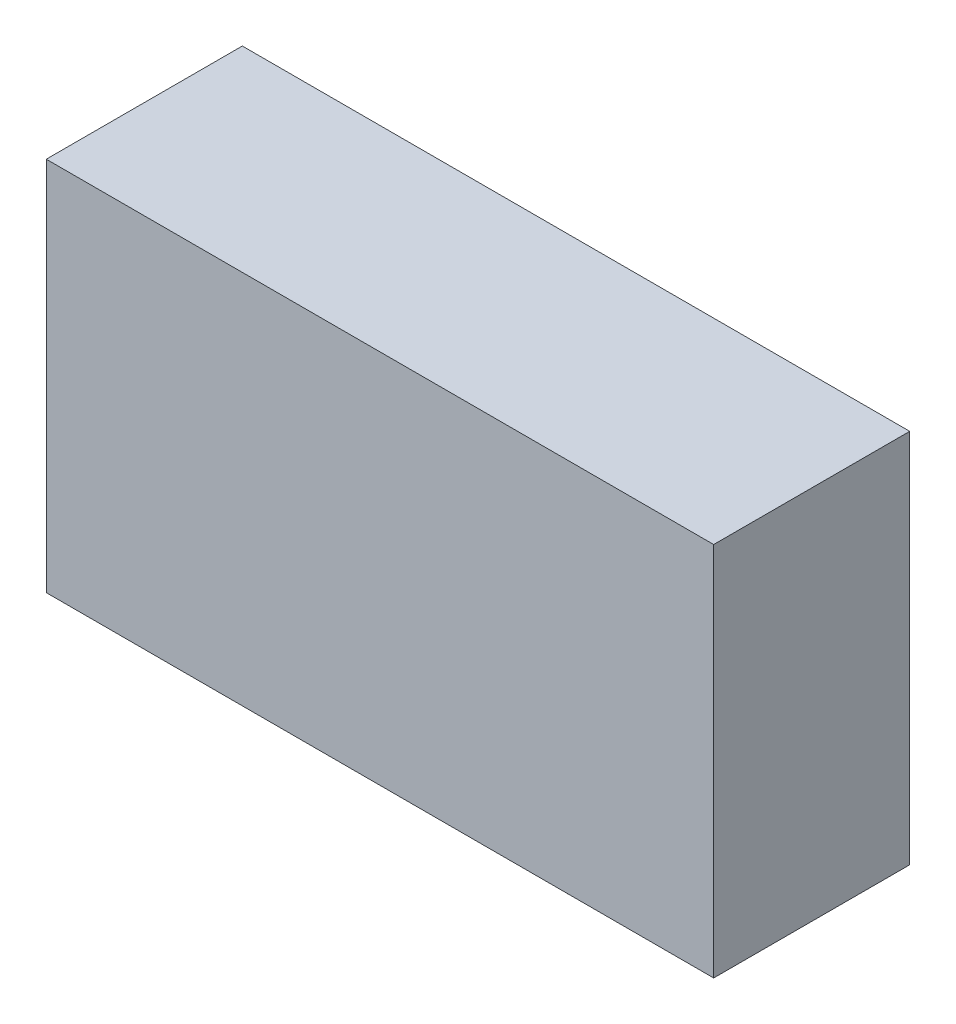
ISO-10303-21;
HEADER;
FILE_DESCRIPTION(('STEP AP214'),'2;1');
FILE_NAME('part.step','',(''),(''),'','','');
FILE_SCHEMA(('AUTOMOTIVE_DESIGN { 1 0 10303 214 1 1 1 1 }'));
ENDSEC;
DATA;
#1=APPLICATION_CONTEXT('core data for automotive mechanical design processes');
#2=APPLICATION_PROTOCOL_DEFINITION('international standard','automotive_design',2000,#1);
#3=PRODUCT_CONTEXT('',#1,'mechanical');
#4=PRODUCT('Part','Part','',(#3));
#5=PRODUCT_RELATED_PRODUCT_CATEGORY('part','',(#4));
#6=PRODUCT_DEFINITION_FORMATION('','',#4);
#7=PRODUCT_DEFINITION_CONTEXT('part definition',#1,'design');
#8=PRODUCT_DEFINITION('design','',#6,#7);
#9=PRODUCT_DEFINITION_SHAPE('','',#8);
#10=(LENGTH_UNIT() NAMED_UNIT(*) SI_UNIT(.MILLI.,.METRE.));
#11=(NAMED_UNIT(*) PLANE_ANGLE_UNIT() SI_UNIT($,.RADIAN.));
#12=(NAMED_UNIT(*) SI_UNIT($,.STERADIAN.) SOLID_ANGLE_UNIT());
#13=UNCERTAINTY_MEASURE_WITH_UNIT(LENGTH_MEASURE(1.E-05),#10,'distance_accuracy_value','');
#14=(GEOMETRIC_REPRESENTATION_CONTEXT(3) GLOBAL_UNCERTAINTY_ASSIGNED_CONTEXT((#13)) GLOBAL_UNIT_ASSIGNED_CONTEXT((#10,
#11,#12)) REPRESENTATION_CONTEXT('',''));
#15=CARTESIAN_POINT('',(0.,0.,0.));
#16=DIRECTION('',(0.,0.,1.));
#17=DIRECTION('',(1.,0.,0.));
#18=AXIS2_PLACEMENT_3D('',#15,#16,#17);
#19=CARTESIAN_POINT('',(0.,0.,2.35));
#20=DIRECTION('',(1.,0.,0.));
#21=DIRECTION('',(0.,0.,-1.));
#22=AXIS2_PLACEMENT_3D('',#19,#20,#21);
#23=PLANE('',#22);
#24=DIRECTION('',(0.,-1.,0.));
#25=VECTOR('',#24,1.);
#26=CARTESIAN_POINT('',(0.,0.,0.));
#27=LINE('',#26,#25);
#28=CARTESIAN_POINT('',(0.,4.5,0.));
#29=VERTEX_POINT('',#28);
#30=CARTESIAN_POINT('',(0.,0.,0.));
#31=VERTEX_POINT('',#30);
#32=EDGE_CURVE('E111',#29,#31,#27,.T.);
#33=ORIENTED_EDGE('',*,*,#32,.T.);
#34=DIRECTION('',(0.,0.,-1.));
#35=VECTOR('',#34,1.);
#36=CARTESIAN_POINT('',(0.,0.,2.35));
#37=LINE('',#36,#35);
#38=CARTESIAN_POINT('',(0.,0.,2.35));
#39=VERTEX_POINT('',#38);
#40=EDGE_CURVE('E11',#39,#31,#37,.T.);
#41=ORIENTED_EDGE('',*,*,#40,.F.);
#42=DIRECTION('',(0.,-1.,0.));
#43=VECTOR('',#42,1.);
#44=CARTESIAN_POINT('',(0.,0.,2.35));
#45=LINE('',#44,#43);
#46=CARTESIAN_POINT('',(0.,4.5,2.35));
#47=VERTEX_POINT('',#46);
#48=EDGE_CURVE('E95',#47,#39,#45,.T.);
#49=ORIENTED_EDGE('',*,*,#48,.F.);
#50=DIRECTION('',(0.,0.,-1.));
#51=VECTOR('',#50,1.);
#52=CARTESIAN_POINT('',(0.,4.5,2.35));
#53=LINE('',#52,#51);
#54=EDGE_CURVE('E107',#47,#29,#53,.T.);
#55=ORIENTED_EDGE('',*,*,#54,.T.);
#56=EDGE_LOOP('',(#33,#41,#49,#55));
#57=FACE_BOUND('',#56,.T.);
#58=ADVANCED_FACE('F43',(#57),#23,.F.);
#59=CARTESIAN_POINT('',(0.,0.,2.35));
#60=DIRECTION('',(0.,1.,0.));
#61=DIRECTION('',(0.,0.,1.));
#62=AXIS2_PLACEMENT_3D('',#59,#60,#61);
#63=PLANE('',#62);
#64=DIRECTION('',(1.,0.,0.));
#65=VECTOR('',#64,1.);
#66=CARTESIAN_POINT('',(0.,0.,0.));
#67=LINE('',#66,#65);
#68=CARTESIAN_POINT('',(8.,0.,0.));
#69=VERTEX_POINT('',#68);
#70=EDGE_CURVE('E100',#31,#69,#67,.T.);
#71=ORIENTED_EDGE('',*,*,#70,.T.);
#72=DIRECTION('',(0.,0.,-1.));
#73=VECTOR('',#72,1.);
#74=CARTESIAN_POINT('',(8.,0.,2.35));
#75=LINE('',#74,#73);
#76=CARTESIAN_POINT('',(8.,0.,2.35));
#77=VERTEX_POINT('',#76);
#78=EDGE_CURVE('E52',#77,#69,#75,.T.);
#79=ORIENTED_EDGE('',*,*,#78,.F.);
#80=DIRECTION('',(1.,0.,0.));
#81=VECTOR('',#80,1.);
#82=CARTESIAN_POINT('',(0.,0.,2.35));
#83=LINE('',#82,#81);
#84=EDGE_CURVE('E90',#39,#77,#83,.T.);
#85=ORIENTED_EDGE('',*,*,#84,.F.);
#86=ORIENTED_EDGE('',*,*,#40,.T.);
#87=EDGE_LOOP('',(#71,#79,#85,#86));
#88=FACE_BOUND('',#87,.T.);
#89=ADVANCED_FACE('F99',(#88),#63,.F.);
#90=CARTESIAN_POINT('',(8.,0.,2.35));
#91=DIRECTION('',(-1.,0.,0.));
#92=DIRECTION('',(0.,0.,1.));
#93=AXIS2_PLACEMENT_3D('',#90,#91,#92);
#94=PLANE('',#93);
#95=DIRECTION('',(0.,1.,0.));
#96=VECTOR('',#95,1.);
#97=CARTESIAN_POINT('',(8.,0.,0.));
#98=LINE('',#97,#96);
#99=CARTESIAN_POINT('',(8.,4.5,0.));
#100=VERTEX_POINT('',#99);
#101=EDGE_CURVE('E77',#69,#100,#98,.T.);
#102=ORIENTED_EDGE('',*,*,#101,.T.);
#103=DIRECTION('',(0.,0.,-1.));
#104=VECTOR('',#103,1.);
#105=CARTESIAN_POINT('',(8.,4.5,2.35));
#106=LINE('',#105,#104);
#107=CARTESIAN_POINT('',(8.,4.5,2.35));
#108=VERTEX_POINT('',#107);
#109=EDGE_CURVE('E102',#108,#100,#106,.T.);
#110=ORIENTED_EDGE('',*,*,#109,.F.);
#111=DIRECTION('',(0.,1.,0.));
#112=VECTOR('',#111,1.);
#113=CARTESIAN_POINT('',(8.,0.,2.35));
#114=LINE('',#113,#112);
#115=EDGE_CURVE('E93',#77,#108,#114,.T.);
#116=ORIENTED_EDGE('',*,*,#115,.F.);
#117=ORIENTED_EDGE('',*,*,#78,.T.);
#118=EDGE_LOOP('',(#102,#110,#116,#117));
#119=FACE_BOUND('',#118,.T.);
#120=ADVANCED_FACE('F103',(#119),#94,.F.);
#121=CARTESIAN_POINT('',(0.,4.5,2.35));
#122=DIRECTION('',(0.,-1.,0.));
#123=DIRECTION('',(0.,0.,-1.));
#124=AXIS2_PLACEMENT_3D('',#121,#122,#123);
#125=PLANE('',#124);
#126=DIRECTION('',(-1.,0.,0.));
#127=VECTOR('',#126,1.);
#128=CARTESIAN_POINT('',(0.,4.5,0.));
#129=LINE('',#128,#127);
#130=EDGE_CURVE('E83',#100,#29,#129,.T.);
#131=ORIENTED_EDGE('',*,*,#130,.T.);
#132=ORIENTED_EDGE('',*,*,#54,.F.);
#133=DIRECTION('',(-1.,0.,0.));
#134=VECTOR('',#133,1.);
#135=CARTESIAN_POINT('',(0.,4.5,2.35));
#136=LINE('',#135,#134);
#137=EDGE_CURVE('E60',#108,#47,#136,.T.);
#138=ORIENTED_EDGE('',*,*,#137,.F.);
#139=ORIENTED_EDGE('',*,*,#109,.T.);
#140=EDGE_LOOP('',(#131,#132,#138,#139));
#141=FACE_BOUND('',#140,.T.);
#142=ADVANCED_FACE('F124',(#141),#125,.F.);
#143=CARTESIAN_POINT('',(0.,0.,2.35));
#144=DIRECTION('',(0.,0.,-1.));
#145=DIRECTION('',(-1.,0.,0.));
#146=AXIS2_PLACEMENT_3D('',#143,#144,#145);
#147=PLANE('',#146);
#148=ORIENTED_EDGE('',*,*,#48,.T.);
#149=ORIENTED_EDGE('',*,*,#84,.T.);
#150=ORIENTED_EDGE('',*,*,#115,.T.);
#151=ORIENTED_EDGE('',*,*,#137,.T.);
#152=EDGE_LOOP('',(#148,#149,#150,#151));
#153=FACE_BOUND('',#152,.T.);
#154=ADVANCED_FACE('F91',(#153),#147,.F.);
#155=CARTESIAN_POINT('',(0.,0.,0.));
#156=DIRECTION('',(0.,0.,-1.));
#157=DIRECTION('',(-1.,0.,0.));
#158=AXIS2_PLACEMENT_3D('',#155,#156,#157);
#159=PLANE('',#158);
#160=ORIENTED_EDGE('',*,*,#32,.F.);
#161=ORIENTED_EDGE('',*,*,#130,.F.);
#162=ORIENTED_EDGE('',*,*,#101,.F.);
#163=ORIENTED_EDGE('',*,*,#70,.F.);
#164=EDGE_LOOP('',(#160,#161,#162,#163));
#165=FACE_BOUND('',#164,.T.);
#166=ADVANCED_FACE('F127',(#165),#159,.T.);
#167=CLOSED_SHELL('',(#58,#89,#120,#142,#154,#166));
#168=MANIFOLD_SOLID_BREP('B2',#167);
#169=ADVANCED_BREP_SHAPE_REPRESENTATION('',(#18,#168),#14);
#170=SHAPE_DEFINITION_REPRESENTATION(#9,#169);
ENDSEC;
END-ISO-10303-21;
